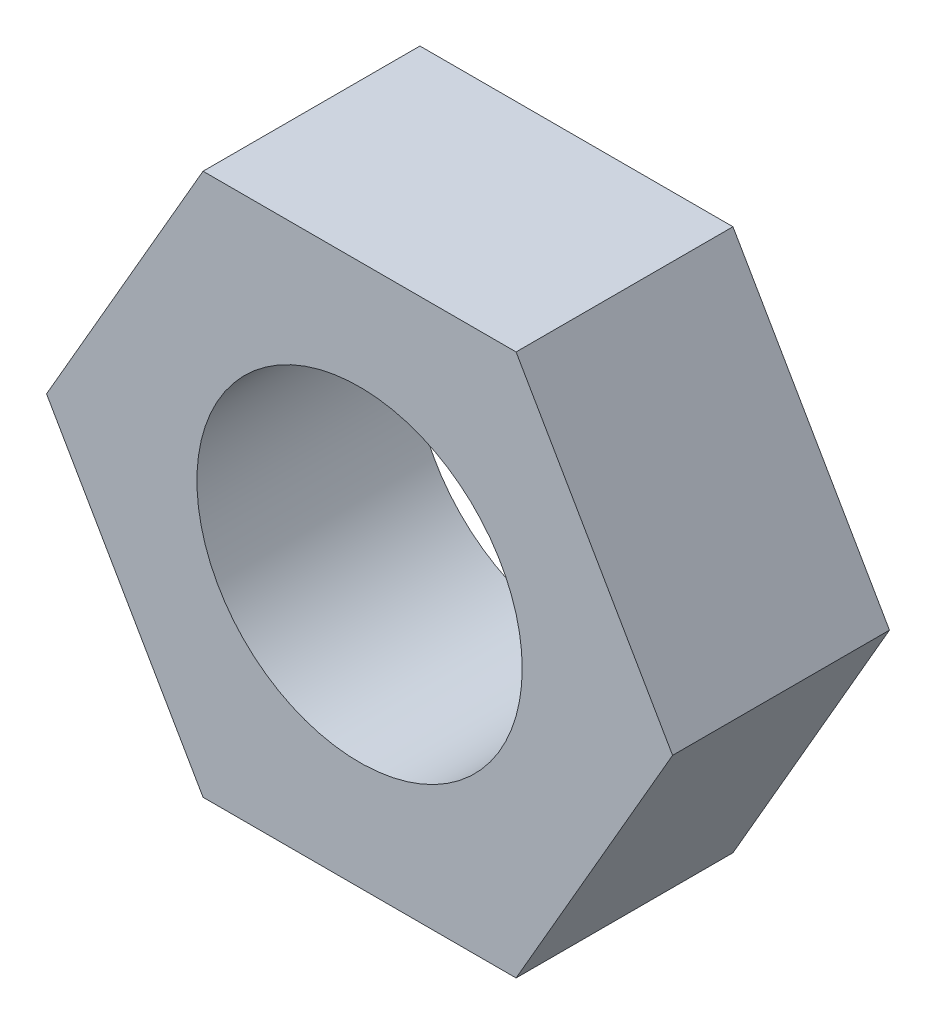
ISO-10303-21;
HEADER;
FILE_DESCRIPTION(('STEP AP214'),'2;1');
FILE_NAME('part.step','',(''),(''),'','','');
FILE_SCHEMA(('AUTOMOTIVE_DESIGN { 1 0 10303 214 1 1 1 1 }'));
ENDSEC;
DATA;
#1=APPLICATION_CONTEXT('core data for automotive mechanical design processes');
#2=APPLICATION_PROTOCOL_DEFINITION('international standard','automotive_design',2000,#1);
#3=PRODUCT_CONTEXT('',#1,'mechanical');
#4=PRODUCT('Part','Part','',(#3));
#5=PRODUCT_RELATED_PRODUCT_CATEGORY('part','',(#4));
#6=PRODUCT_DEFINITION_FORMATION('','',#4);
#7=PRODUCT_DEFINITION_CONTEXT('part definition',#1,'design');
#8=PRODUCT_DEFINITION('design','',#6,#7);
#9=PRODUCT_DEFINITION_SHAPE('','',#8);
#10=(LENGTH_UNIT() NAMED_UNIT(*) SI_UNIT(.MILLI.,.METRE.));
#11=(NAMED_UNIT(*) PLANE_ANGLE_UNIT() SI_UNIT($,.RADIAN.));
#12=(NAMED_UNIT(*) SI_UNIT($,.STERADIAN.) SOLID_ANGLE_UNIT());
#13=UNCERTAINTY_MEASURE_WITH_UNIT(LENGTH_MEASURE(1.E-05),#10,'distance_accuracy_value','');
#14=(GEOMETRIC_REPRESENTATION_CONTEXT(3) GLOBAL_UNCERTAINTY_ASSIGNED_CONTEXT((#13)) GLOBAL_UNIT_ASSIGNED_CONTEXT((#10,
#11,#12)) REPRESENTATION_CONTEXT('',''));
#15=CARTESIAN_POINT('',(0.,0.,0.));
#16=DIRECTION('',(0.,0.,1.));
#17=DIRECTION('',(1.,0.,0.));
#18=AXIS2_PLACEMENT_3D('',#15,#16,#17);
#19=CARTESIAN_POINT('',(2.88675134597725,-4.99999999999998,-4.));
#20=DIRECTION('',(0.866025403794434,-0.499999999982687,0.));
#21=DIRECTION('',(0.499999999982687,0.866025403794434,0.));
#22=AXIS2_PLACEMENT_3D('',#19,#20,#21);
#23=PLANE('',#22);
#24=DIRECTION('',(0.499999999982687,0.866025403794434,0.));
#25=VECTOR('',#24,1.);
#26=CARTESIAN_POINT('',(2.88675134597725,-4.99999999999998,0.));
#27=LINE('',#26,#25);
#28=CARTESIAN_POINT('',(2.88675134597725,-4.99999999999998,0.));
#29=VERTEX_POINT('',#28);
#30=CARTESIAN_POINT('',(5.77350269191811,2.18278728425503E-10,0.));
#31=VERTEX_POINT('',#30);
#32=EDGE_CURVE('E121',#29,#31,#27,.T.);
#33=ORIENTED_EDGE('',*,*,#32,.F.);
#34=DIRECTION('',(0.,0.,1.));
#35=VECTOR('',#34,1.);
#36=CARTESIAN_POINT('',(2.88675134597725,-4.99999999999998,-4.));
#37=LINE('',#36,#35);
#38=CARTESIAN_POINT('',(2.88675134597725,-4.99999999999998,-4.));
#39=VERTEX_POINT('',#38);
#40=EDGE_CURVE('E11',#39,#29,#37,.T.);
#41=ORIENTED_EDGE('',*,*,#40,.F.);
#42=DIRECTION('',(0.499999999982687,0.866025403794434,0.));
#43=VECTOR('',#42,1.);
#44=CARTESIAN_POINT('',(2.88675134597725,-4.99999999999998,-4.));
#45=LINE('',#44,#43);
#46=CARTESIAN_POINT('',(5.77350269191811,2.18278728425503E-10,-4.));
#47=VERTEX_POINT('',#46);
#48=EDGE_CURVE('E136',#39,#47,#45,.T.);
#49=ORIENTED_EDGE('',*,*,#48,.T.);
#50=DIRECTION('',(0.,0.,1.));
#51=VECTOR('',#50,1.);
#52=CARTESIAN_POINT('',(5.77350269191811,2.18278728425503E-10,-4.));
#53=LINE('',#52,#51);
#54=EDGE_CURVE('E39',#47,#31,#53,.T.);
#55=ORIENTED_EDGE('',*,*,#54,.T.);
#56=EDGE_LOOP('',(#33,#41,#49,#55));
#57=FACE_BOUND('',#56,.T.);
#58=ADVANCED_FACE('F36',(#57),#23,.T.);
#59=CARTESIAN_POINT('',(-2.88675134605,-4.99999999992723,-4.));
#60=DIRECTION('',(-1.26009641595418E-11,-1.,0.));
#61=DIRECTION('',(1.,-1.26009641595418E-11,0.));
#62=AXIS2_PLACEMENT_3D('',#59,#60,#61);
#63=PLANE('',#62);
#64=DIRECTION('',(1.,-1.26009641595418E-11,0.));
#65=VECTOR('',#64,1.);
#66=CARTESIAN_POINT('',(-2.88675134605,-4.99999999992723,0.));
#67=LINE('',#66,#65);
#68=CARTESIAN_POINT('',(-2.88675134605,-4.99999999992723,0.));
#69=VERTEX_POINT('',#68);
#70=EDGE_CURVE('E134',#69,#29,#67,.T.);
#71=ORIENTED_EDGE('',*,*,#70,.F.);
#72=DIRECTION('',(0.,0.,1.));
#73=VECTOR('',#72,1.);
#74=CARTESIAN_POINT('',(-2.88675134605,-4.99999999992723,-4.));
#75=LINE('',#74,#73);
#76=CARTESIAN_POINT('',(-2.88675134605,-4.99999999992723,-4.));
#77=VERTEX_POINT('',#76);
#78=EDGE_CURVE('E45',#77,#69,#75,.T.);
#79=ORIENTED_EDGE('',*,*,#78,.F.);
#80=DIRECTION('',(1.,-1.26009641595418E-11,0.));
#81=VECTOR('',#80,1.);
#82=CARTESIAN_POINT('',(-2.88675134605,-4.99999999992723,-4.));
#83=LINE('',#82,#81);
#84=EDGE_CURVE('E111',#77,#39,#83,.T.);
#85=ORIENTED_EDGE('',*,*,#84,.T.);
#86=ORIENTED_EDGE('',*,*,#40,.T.);
#87=EDGE_LOOP('',(#71,#79,#85,#86));
#88=FACE_BOUND('',#87,.T.);
#89=ADVANCED_FACE('F144',(#88),#63,.T.);
#90=CARTESIAN_POINT('',(-5.77350269191811,2.91038304567337E-10,-4.));
#91=DIRECTION('',(-0.866025403799892,-0.499999999973235,0.));
#92=DIRECTION('',(0.499999999973235,-0.866025403799892,0.));
#93=AXIS2_PLACEMENT_3D('',#90,#91,#92);
#94=PLANE('',#93);
#95=DIRECTION('',(0.499999999973235,-0.866025403799892,0.));
#96=VECTOR('',#95,1.);
#97=CARTESIAN_POINT('',(-5.77350269191811,2.91038304567337E-10,0.));
#98=LINE('',#97,#96);
#99=CARTESIAN_POINT('',(-5.77350269191811,2.91038304567337E-10,0.));
#100=VERTEX_POINT('',#99);
#101=EDGE_CURVE('E98',#100,#69,#98,.T.);
#102=ORIENTED_EDGE('',*,*,#101,.F.);
#103=DIRECTION('',(0.,0.,1.));
#104=VECTOR('',#103,1.);
#105=CARTESIAN_POINT('',(-5.77350269191811,2.91038304567337E-10,-4.));
#106=LINE('',#105,#104);
#107=CARTESIAN_POINT('',(-5.77350269191811,2.91038304567337E-10,-4.));
#108=VERTEX_POINT('',#107);
#109=EDGE_CURVE('E93',#108,#100,#106,.T.);
#110=ORIENTED_EDGE('',*,*,#109,.F.);
#111=DIRECTION('',(0.499999999973235,-0.866025403799892,0.));
#112=VECTOR('',#111,1.);
#113=CARTESIAN_POINT('',(-5.77350269191811,2.91038304567337E-10,-4.));
#114=LINE('',#113,#112);
#115=EDGE_CURVE('E96',#108,#77,#114,.T.);
#116=ORIENTED_EDGE('',*,*,#115,.T.);
#117=ORIENTED_EDGE('',*,*,#78,.T.);
#118=EDGE_LOOP('',(#102,#110,#116,#117));
#119=FACE_BOUND('',#118,.T.);
#120=ADVANCED_FACE('F95',(#119),#94,.T.);
#121=CARTESIAN_POINT('',(-2.88675134605,4.99999999999999,-4.));
#122=DIRECTION('',(-0.866025403777838,0.500000000011433,0.));
#123=DIRECTION('',(-0.500000000011433,-0.866025403777838,0.));
#124=AXIS2_PLACEMENT_3D('',#121,#122,#123);
#125=PLANE('',#124);
#126=DIRECTION('',(-0.500000000011433,-0.866025403777838,0.));
#127=VECTOR('',#126,1.);
#128=CARTESIAN_POINT('',(-2.88675134605,4.99999999999999,0.));
#129=LINE('',#128,#127);
#130=CARTESIAN_POINT('',(-2.88675134605,4.99999999999999,0.));
#131=VERTEX_POINT('',#130);
#132=EDGE_CURVE('E131',#131,#100,#129,.T.);
#133=ORIENTED_EDGE('',*,*,#132,.F.);
#134=DIRECTION('',(0.,0.,1.));
#135=VECTOR('',#134,1.);
#136=CARTESIAN_POINT('',(-2.88675134605,4.99999999999999,-4.));
#137=LINE('',#136,#135);
#138=CARTESIAN_POINT('',(-2.88675134605,4.99999999999999,-4.));
#139=VERTEX_POINT('',#138);
#140=EDGE_CURVE('E103',#139,#131,#137,.T.);
#141=ORIENTED_EDGE('',*,*,#140,.F.);
#142=DIRECTION('',(-0.500000000011433,-0.866025403777838,0.));
#143=VECTOR('',#142,1.);
#144=CARTESIAN_POINT('',(-2.88675134605,4.99999999999999,-4.));
#145=LINE('',#144,#143);
#146=EDGE_CURVE('E109',#139,#108,#145,.T.);
#147=ORIENTED_EDGE('',*,*,#146,.T.);
#148=ORIENTED_EDGE('',*,*,#109,.T.);
#149=EDGE_LOOP('',(#133,#141,#147,#148));
#150=FACE_BOUND('',#149,.T.);
#151=ADVANCED_FACE('F113',(#150),#125,.T.);
#152=CARTESIAN_POINT('',(2.88675134594087,4.99999999992723,-4.));
#153=DIRECTION('',(1.26026167056798E-11,1.,0.));
#154=DIRECTION('',(-1.,1.26026167056798E-11,0.));
#155=AXIS2_PLACEMENT_3D('',#152,#153,#154);
#156=PLANE('',#155);
#157=DIRECTION('',(-1.,1.26026167056798E-11,0.));
#158=VECTOR('',#157,1.);
#159=CARTESIAN_POINT('',(2.88675134594087,4.99999999992723,0.));
#160=LINE('',#159,#158);
#161=CARTESIAN_POINT('',(2.88675134594087,4.99999999992723,0.));
#162=VERTEX_POINT('',#161);
#163=EDGE_CURVE('E128',#162,#131,#160,.T.);
#164=ORIENTED_EDGE('',*,*,#163,.F.);
#165=DIRECTION('',(0.,0.,1.));
#166=VECTOR('',#165,1.);
#167=CARTESIAN_POINT('',(2.88675134594087,4.99999999992723,-4.));
#168=LINE('',#167,#166);
#169=CARTESIAN_POINT('',(2.88675134594087,4.99999999992723,-4.));
#170=VERTEX_POINT('',#169);
#171=EDGE_CURVE('E139',#170,#162,#168,.T.);
#172=ORIENTED_EDGE('',*,*,#171,.F.);
#173=DIRECTION('',(-1.,1.26026167056798E-11,0.));
#174=VECTOR('',#173,1.);
#175=CARTESIAN_POINT('',(2.88675134594087,4.99999999992723,-4.));
#176=LINE('',#175,#174);
#177=EDGE_CURVE('E114',#170,#139,#176,.T.);
#178=ORIENTED_EDGE('',*,*,#177,.T.);
#179=ORIENTED_EDGE('',*,*,#140,.T.);
#180=EDGE_LOOP('',(#164,#172,#178,#179));
#181=FACE_BOUND('',#180,.T.);
#182=ADVANCED_FACE('F157',(#181),#156,.T.);
#183=CARTESIAN_POINT('',(5.77350269191811,2.18278728425503E-10,-4.));
#184=DIRECTION('',(0.866025403769652,0.500000000025611,0.));
#185=DIRECTION('',(-0.500000000025611,0.866025403769652,0.));
#186=AXIS2_PLACEMENT_3D('',#183,#184,#185);
#187=PLANE('',#186);
#188=DIRECTION('',(-0.500000000025611,0.866025403769652,0.));
#189=VECTOR('',#188,1.);
#190=CARTESIAN_POINT('',(5.77350269191811,2.18278728425503E-10,0.));
#191=LINE('',#190,#189);
#192=EDGE_CURVE('E124',#31,#162,#191,.T.);
#193=ORIENTED_EDGE('',*,*,#192,.F.);
#194=ORIENTED_EDGE('',*,*,#54,.F.);
#195=DIRECTION('',(-0.500000000025611,0.866025403769652,0.));
#196=VECTOR('',#195,1.);
#197=CARTESIAN_POINT('',(5.77350269191811,2.18278728425503E-10,-4.));
#198=LINE('',#197,#196);
#199=EDGE_CURVE('E116',#47,#170,#198,.T.);
#200=ORIENTED_EDGE('',*,*,#199,.T.);
#201=ORIENTED_EDGE('',*,*,#171,.T.);
#202=EDGE_LOOP('',(#193,#194,#200,#201));
#203=FACE_BOUND('',#202,.T.);
#204=ADVANCED_FACE('F141',(#203),#187,.T.);
#205=CARTESIAN_POINT('',(0.,0.,-4.));
#206=DIRECTION('',(0.,0.,1.));
#207=DIRECTION('',(1.,0.,0.));
#208=AXIS2_PLACEMENT_3D('',#205,#206,#207);
#209=PLANE('',#208);
#210=CARTESIAN_POINT('',(0.,0.,-4.));
#211=DIRECTION('',(0.,0.,1.));
#212=DIRECTION('',(1.,0.,0.));
#213=AXIS2_PLACEMENT_3D('',#210,#211,#212);
#214=CIRCLE('',#213,3.);
#215=CARTESIAN_POINT('',(3.,0.,-4.));
#216=VERTEX_POINT('',#215);
#217=EDGE_CURVE('E125',#216,#216,#214,.T.);
#218=ORIENTED_EDGE('',*,*,#217,.T.);
#219=EDGE_LOOP('',(#218));
#220=FACE_BOUND('',#219,.T.);
#221=ORIENTED_EDGE('',*,*,#48,.F.);
#222=ORIENTED_EDGE('',*,*,#84,.F.);
#223=ORIENTED_EDGE('',*,*,#115,.F.);
#224=ORIENTED_EDGE('',*,*,#146,.F.);
#225=ORIENTED_EDGE('',*,*,#177,.F.);
#226=ORIENTED_EDGE('',*,*,#199,.F.);
#227=EDGE_LOOP('',(#221,#222,#223,#224,#225,#226));
#228=FACE_BOUND('',#227,.T.);
#229=ADVANCED_FACE('F107',(#220,#228),#209,.F.);
#230=CARTESIAN_POINT('',(0.,0.,0.));
#231=DIRECTION('',(0.,0.,1.));
#232=DIRECTION('',(1.,0.,0.));
#233=AXIS2_PLACEMENT_3D('',#230,#231,#232);
#234=PLANE('',#233);
#235=CARTESIAN_POINT('',(0.,0.,0.));
#236=DIRECTION('',(0.,0.,1.));
#237=DIRECTION('',(1.,0.,0.));
#238=AXIS2_PLACEMENT_3D('',#235,#236,#237);
#239=CIRCLE('',#238,3.);
#240=CARTESIAN_POINT('',(3.,0.,0.));
#241=VERTEX_POINT('',#240);
#242=EDGE_CURVE('E180',#241,#241,#239,.T.);
#243=ORIENTED_EDGE('',*,*,#242,.F.);
#244=EDGE_LOOP('',(#243));
#245=FACE_BOUND('',#244,.T.);
#246=ORIENTED_EDGE('',*,*,#32,.T.);
#247=ORIENTED_EDGE('',*,*,#192,.T.);
#248=ORIENTED_EDGE('',*,*,#163,.T.);
#249=ORIENTED_EDGE('',*,*,#132,.T.);
#250=ORIENTED_EDGE('',*,*,#101,.T.);
#251=ORIENTED_EDGE('',*,*,#70,.T.);
#252=EDGE_LOOP('',(#246,#247,#248,#249,#250,#251));
#253=FACE_BOUND('',#252,.T.);
#254=ADVANCED_FACE('F143',(#245,#253),#234,.T.);
#255=CARTESIAN_POINT('',(0.,0.,-4.));
#256=DIRECTION('',(0.,0.,1.));
#257=DIRECTION('',(1.,0.,0.));
#258=AXIS2_PLACEMENT_3D('',#255,#256,#257);
#259=CYLINDRICAL_SURFACE('',#258,3.);
#260=ORIENTED_EDGE('',*,*,#217,.F.);
#261=EDGE_LOOP('',(#260));
#262=FACE_BOUND('',#261,.T.);
#263=ORIENTED_EDGE('',*,*,#242,.T.);
#264=EDGE_LOOP('',(#263));
#265=FACE_BOUND('',#264,.T.);
#266=ADVANCED_FACE('F168',(#262,#265),#259,.F.);
#267=CLOSED_SHELL('',(#58,#89,#120,#151,#182,#204,#229,#254,#266));
#268=MANIFOLD_SOLID_BREP('B2',#267);
#269=ADVANCED_BREP_SHAPE_REPRESENTATION('',(#18,#268),#14);
#270=SHAPE_DEFINITION_REPRESENTATION(#9,#269);
ENDSEC;
END-ISO-10303-21;
